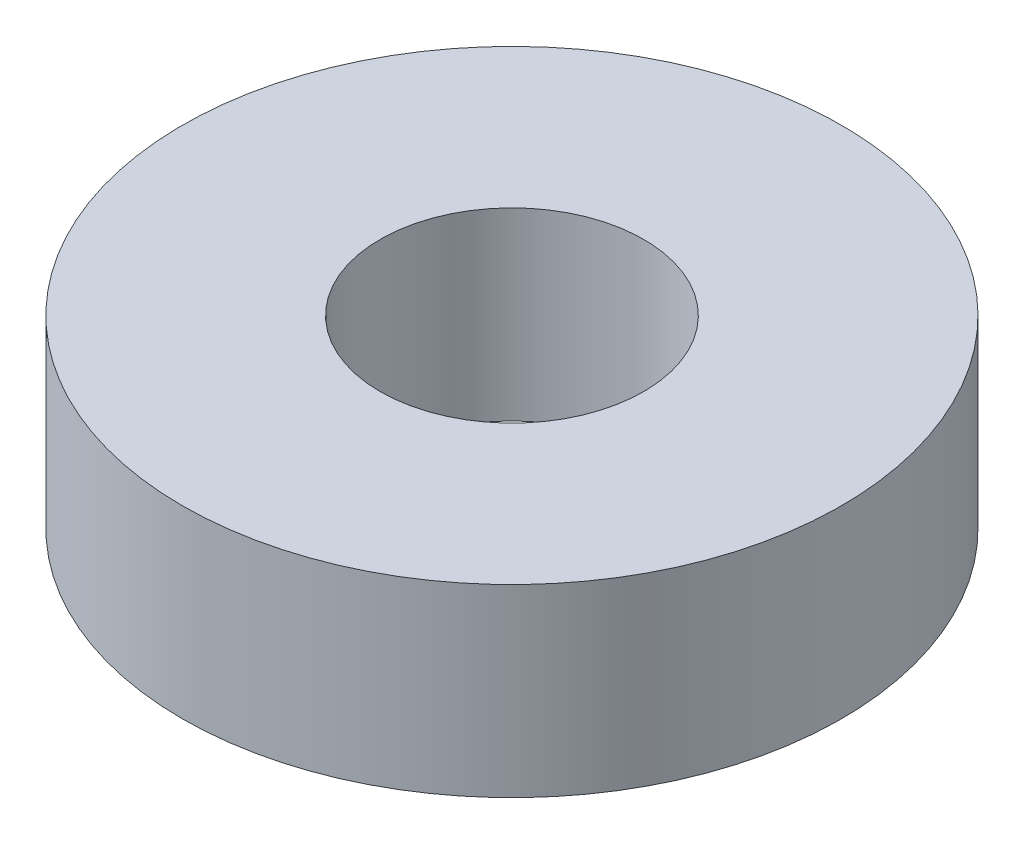
ISO-10303-21;
HEADER;
FILE_DESCRIPTION(('STEP AP214'),'2;1');
FILE_NAME('part.step','',(''),(''),'','','');
FILE_SCHEMA(('AUTOMOTIVE_DESIGN { 1 0 10303 214 1 1 1 1 }'));
ENDSEC;
DATA;
#1=APPLICATION_CONTEXT('core data for automotive mechanical design processes');
#2=APPLICATION_PROTOCOL_DEFINITION('international standard','automotive_design',2000,#1);
#3=PRODUCT_CONTEXT('',#1,'mechanical');
#4=PRODUCT('Part','Part','',(#3));
#5=PRODUCT_RELATED_PRODUCT_CATEGORY('part','',(#4));
#6=PRODUCT_DEFINITION_FORMATION('','',#4);
#7=PRODUCT_DEFINITION_CONTEXT('part definition',#1,'design');
#8=PRODUCT_DEFINITION('design','',#6,#7);
#9=PRODUCT_DEFINITION_SHAPE('','',#8);
#10=(LENGTH_UNIT() NAMED_UNIT(*) SI_UNIT(.MILLI.,.METRE.));
#11=(NAMED_UNIT(*) PLANE_ANGLE_UNIT() SI_UNIT($,.RADIAN.));
#12=(NAMED_UNIT(*) SI_UNIT($,.STERADIAN.) SOLID_ANGLE_UNIT());
#13=UNCERTAINTY_MEASURE_WITH_UNIT(LENGTH_MEASURE(1.E-05),#10,'distance_accuracy_value','');
#14=(GEOMETRIC_REPRESENTATION_CONTEXT(3) GLOBAL_UNCERTAINTY_ASSIGNED_CONTEXT((#13)) GLOBAL_UNIT_ASSIGNED_CONTEXT((#10,
#11,#12)) REPRESENTATION_CONTEXT('',''));
#15=CARTESIAN_POINT('',(0.,0.,0.));
#16=DIRECTION('',(0.,0.,1.));
#17=DIRECTION('',(1.,0.,0.));
#18=AXIS2_PLACEMENT_3D('',#15,#16,#17);
#19=CARTESIAN_POINT('',(0.,28.,0.));
#20=DIRECTION('',(0.,-1.,0.));
#21=DIRECTION('',(0.,0.,-1.));
#22=AXIS2_PLACEMENT_3D('',#19,#20,#21);
#23=CYLINDRICAL_SURFACE('',#22,50.);
#24=CARTESIAN_POINT('',(0.,28.,0.));
#25=DIRECTION('',(0.,1.,0.));
#26=DIRECTION('',(0.,0.,1.));
#27=AXIS2_PLACEMENT_3D('',#24,#25,#26);
#28=CIRCLE('',#27,50.);
#29=CARTESIAN_POINT('',(0.,28.,50.));
#30=VERTEX_POINT('',#29);
#31=EDGE_CURVE('E10',#30,#30,#28,.T.);
#32=ORIENTED_EDGE('',*,*,#31,.F.);
#33=EDGE_LOOP('',(#32));
#34=FACE_BOUND('',#33,.T.);
#35=CARTESIAN_POINT('',(0.,0.,0.));
#36=DIRECTION('',(0.,1.,0.));
#37=DIRECTION('',(0.,0.,1.));
#38=AXIS2_PLACEMENT_3D('',#35,#36,#37);
#39=CIRCLE('',#38,50.);
#40=CARTESIAN_POINT('',(0.,0.,50.));
#41=VERTEX_POINT('',#40);
#42=EDGE_CURVE('E37',#41,#41,#39,.T.);
#43=ORIENTED_EDGE('',*,*,#42,.T.);
#44=EDGE_LOOP('',(#43));
#45=FACE_BOUND('',#44,.T.);
#46=ADVANCED_FACE('F40',(#34,#45),#23,.T.);
#47=CARTESIAN_POINT('',(0.,28.,0.));
#48=DIRECTION('',(0.,1.,0.));
#49=DIRECTION('',(0.,0.,1.));
#50=AXIS2_PLACEMENT_3D('',#47,#48,#49);
#51=PLANE('',#50);
#52=CARTESIAN_POINT('',(0.,28.,0.));
#53=DIRECTION('',(0.,1.,0.));
#54=DIRECTION('',(0.,0.,1.));
#55=AXIS2_PLACEMENT_3D('',#52,#53,#54);
#56=CIRCLE('',#55,20.);
#57=CARTESIAN_POINT('',(0.,28.,20.));
#58=VERTEX_POINT('',#57);
#59=EDGE_CURVE('E50',#58,#58,#56,.T.);
#60=ORIENTED_EDGE('',*,*,#59,.F.);
#61=EDGE_LOOP('',(#60));
#62=FACE_BOUND('',#61,.T.);
#63=ORIENTED_EDGE('',*,*,#31,.T.);
#64=EDGE_LOOP('',(#63));
#65=FACE_BOUND('',#64,.T.);
#66=ADVANCED_FACE('F59',(#62,#65),#51,.T.);
#67=CARTESIAN_POINT('',(0.,0.,0.));
#68=DIRECTION('',(0.,1.,0.));
#69=DIRECTION('',(0.,0.,1.));
#70=AXIS2_PLACEMENT_3D('',#67,#68,#69);
#71=PLANE('',#70);
#72=CARTESIAN_POINT('',(0.,0.,0.));
#73=DIRECTION('',(0.,1.,0.));
#74=DIRECTION('',(0.,0.,1.));
#75=AXIS2_PLACEMENT_3D('',#72,#73,#74);
#76=CIRCLE('',#75,20.);
#77=CARTESIAN_POINT('',(0.,0.,20.));
#78=VERTEX_POINT('',#77);
#79=EDGE_CURVE('E47',#78,#78,#76,.T.);
#80=ORIENTED_EDGE('',*,*,#79,.T.);
#81=EDGE_LOOP('',(#80));
#82=FACE_BOUND('',#81,.T.);
#83=ORIENTED_EDGE('',*,*,#42,.F.);
#84=EDGE_LOOP('',(#83));
#85=FACE_BOUND('',#84,.T.);
#86=ADVANCED_FACE('F58',(#82,#85),#71,.F.);
#87=CARTESIAN_POINT('',(0.,28.,0.));
#88=DIRECTION('',(0.,-1.,0.));
#89=DIRECTION('',(0.,0.,-1.));
#90=AXIS2_PLACEMENT_3D('',#87,#88,#89);
#91=CYLINDRICAL_SURFACE('',#90,20.);
#92=ORIENTED_EDGE('',*,*,#59,.T.);
#93=EDGE_LOOP('',(#92));
#94=FACE_BOUND('',#93,.T.);
#95=ORIENTED_EDGE('',*,*,#79,.F.);
#96=EDGE_LOOP('',(#95));
#97=FACE_BOUND('',#96,.T.);
#98=ADVANCED_FACE('F54',(#94,#97),#91,.F.);
#99=CLOSED_SHELL('',(#46,#66,#86,#98));
#100=MANIFOLD_SOLID_BREP('B2',#99);
#101=ADVANCED_BREP_SHAPE_REPRESENTATION('',(#18,#100),#14);
#102=SHAPE_DEFINITION_REPRESENTATION(#9,#101);
ENDSEC;
END-ISO-10303-21;
